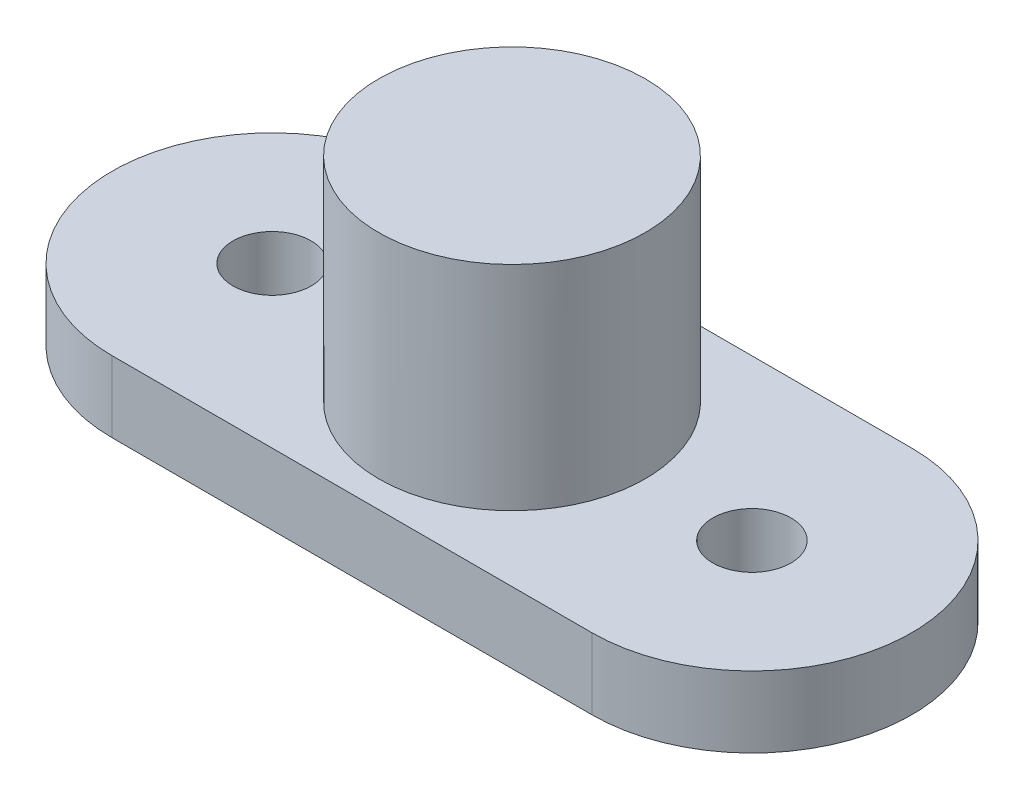
ISO-10303-21;
HEADER;
FILE_DESCRIPTION(('STEP AP214'),'2;1');
FILE_NAME('part.step','',(''),(''),'','','');
FILE_SCHEMA(('AUTOMOTIVE_DESIGN { 1 0 10303 214 1 1 1 1 }'));
ENDSEC;
DATA;
#1=APPLICATION_CONTEXT('core data for automotive mechanical design processes');
#2=APPLICATION_PROTOCOL_DEFINITION('international standard','automotive_design',2000,#1);
#3=PRODUCT_CONTEXT('',#1,'mechanical');
#4=PRODUCT('Part','Part','',(#3));
#5=PRODUCT_RELATED_PRODUCT_CATEGORY('part','',(#4));
#6=PRODUCT_DEFINITION_FORMATION('','',#4);
#7=PRODUCT_DEFINITION_CONTEXT('part definition',#1,'design');
#8=PRODUCT_DEFINITION('design','',#6,#7);
#9=PRODUCT_DEFINITION_SHAPE('','',#8);
#10=(LENGTH_UNIT() NAMED_UNIT(*) SI_UNIT(.MILLI.,.METRE.));
#11=(NAMED_UNIT(*) PLANE_ANGLE_UNIT() SI_UNIT($,.RADIAN.));
#12=(NAMED_UNIT(*) SI_UNIT($,.STERADIAN.) SOLID_ANGLE_UNIT());
#13=UNCERTAINTY_MEASURE_WITH_UNIT(LENGTH_MEASURE(1.E-05),#10,'distance_accuracy_value','');
#14=(GEOMETRIC_REPRESENTATION_CONTEXT(3) GLOBAL_UNCERTAINTY_ASSIGNED_CONTEXT((#13)) GLOBAL_UNIT_ASSIGNED_CONTEXT((#10,
#11,#12)) REPRESENTATION_CONTEXT('',''));
#15=CARTESIAN_POINT('',(0.,0.,0.));
#16=DIRECTION('',(0.,0.,1.));
#17=DIRECTION('',(1.,0.,0.));
#18=AXIS2_PLACEMENT_3D('',#15,#16,#17);
#19=CARTESIAN_POINT('',(0.,2.,-4.49950296687665));
#20=DIRECTION('',(0.,0.,-1.));
#21=DIRECTION('',(-1.,0.,0.));
#22=AXIS2_PLACEMENT_3D('',#19,#20,#21);
#23=PLANE('',#22);
#24=DIRECTION('',(1.,0.,0.));
#25=VECTOR('',#24,1.);
#26=CARTESIAN_POINT('',(0.,0.,-4.49950296687665));
#27=LINE('',#26,#25);
#28=CARTESIAN_POINT('',(-6.75,0.,-4.49950296687665));
#29=VERTEX_POINT('',#28);
#30=CARTESIAN_POINT('',(6.75,0.,-4.49950296687665));
#31=VERTEX_POINT('',#30);
#32=EDGE_CURVE('E119',#29,#31,#27,.T.);
#33=ORIENTED_EDGE('',*,*,#32,.F.);
#34=DIRECTION('',(0.,-1.,0.));
#35=VECTOR('',#34,1.);
#36=CARTESIAN_POINT('',(-6.75,2.,-4.49950296687665));
#37=LINE('',#36,#35);
#38=CARTESIAN_POINT('',(-6.75,2.,-4.49950296687665));
#39=VERTEX_POINT('',#38);
#40=EDGE_CURVE('E11',#39,#29,#37,.T.);
#41=ORIENTED_EDGE('',*,*,#40,.F.);
#42=DIRECTION('',(1.,0.,0.));
#43=VECTOR('',#42,1.);
#44=CARTESIAN_POINT('',(0.,2.,-4.49950296687665));
#45=LINE('',#44,#43);
#46=CARTESIAN_POINT('',(6.75,2.,-4.49950296687665));
#47=VERTEX_POINT('',#46);
#48=EDGE_CURVE('E96',#39,#47,#45,.T.);
#49=ORIENTED_EDGE('',*,*,#48,.T.);
#50=DIRECTION('',(0.,-1.,0.));
#51=VECTOR('',#50,1.);
#52=CARTESIAN_POINT('',(6.75,2.,-4.49950296687665));
#53=LINE('',#52,#51);
#54=EDGE_CURVE('E57',#47,#31,#53,.T.);
#55=ORIENTED_EDGE('',*,*,#54,.T.);
#56=EDGE_LOOP('',(#33,#41,#49,#55));
#57=FACE_BOUND('',#56,.T.);
#58=ADVANCED_FACE('F39',(#57),#23,.T.);
#59=CARTESIAN_POINT('',(-6.75,2.,0.));
#60=DIRECTION('',(0.,-1.,0.));
#61=DIRECTION('',(0.,0.,-1.));
#62=AXIS2_PLACEMENT_3D('',#59,#60,#61);
#63=CYLINDRICAL_SURFACE('',#62,4.49950296687665);
#64=CARTESIAN_POINT('',(-6.75,0.,0.));
#65=DIRECTION('',(0.,1.,0.));
#66=DIRECTION('',(0.,0.,1.));
#67=AXIS2_PLACEMENT_3D('',#64,#65,#66);
#68=CIRCLE('',#67,4.49950296687665);
#69=CARTESIAN_POINT('',(-6.75,0.,4.49950296687665));
#70=VERTEX_POINT('',#69);
#71=EDGE_CURVE('E102',#29,#70,#68,.T.);
#72=ORIENTED_EDGE('',*,*,#71,.T.);
#73=DIRECTION('',(0.,-1.,0.));
#74=VECTOR('',#73,1.);
#75=CARTESIAN_POINT('',(-6.75,2.,4.49950296687665));
#76=LINE('',#75,#74);
#77=CARTESIAN_POINT('',(-6.75,2.,4.49950296687665));
#78=VERTEX_POINT('',#77);
#79=EDGE_CURVE('E49',#78,#70,#76,.T.);
#80=ORIENTED_EDGE('',*,*,#79,.F.);
#81=CARTESIAN_POINT('',(-6.75,2.,0.));
#82=DIRECTION('',(0.,1.,0.));
#83=DIRECTION('',(0.,0.,1.));
#84=AXIS2_PLACEMENT_3D('',#81,#82,#83);
#85=CIRCLE('',#84,4.49950296687665);
#86=EDGE_CURVE('E92',#39,#78,#85,.T.);
#87=ORIENTED_EDGE('',*,*,#86,.F.);
#88=ORIENTED_EDGE('',*,*,#40,.T.);
#89=EDGE_LOOP('',(#72,#80,#87,#88));
#90=FACE_BOUND('',#89,.T.);
#91=ADVANCED_FACE('F100',(#90),#63,.T.);
#92=CARTESIAN_POINT('',(0.,2.,4.49950296687665));
#93=DIRECTION('',(0.,0.,-1.));
#94=DIRECTION('',(-1.,0.,0.));
#95=AXIS2_PLACEMENT_3D('',#92,#93,#94);
#96=PLANE('',#95);
#97=DIRECTION('',(1.,0.,0.));
#98=VECTOR('',#97,1.);
#99=CARTESIAN_POINT('',(0.,0.,4.49950296687665));
#100=LINE('',#99,#98);
#101=CARTESIAN_POINT('',(6.75,0.,4.49950296687665));
#102=VERTEX_POINT('',#101);
#103=EDGE_CURVE('E114',#70,#102,#100,.T.);
#104=ORIENTED_EDGE('',*,*,#103,.T.);
#105=DIRECTION('',(0.,-1.,0.));
#106=VECTOR('',#105,1.);
#107=CARTESIAN_POINT('',(6.75,2.,4.49950296687665));
#108=LINE('',#107,#106);
#109=CARTESIAN_POINT('',(6.75,2.,4.49950296687665));
#110=VERTEX_POINT('',#109);
#111=EDGE_CURVE('E71',#110,#102,#108,.T.);
#112=ORIENTED_EDGE('',*,*,#111,.F.);
#113=DIRECTION('',(1.,0.,0.));
#114=VECTOR('',#113,1.);
#115=CARTESIAN_POINT('',(0.,2.,4.49950296687665));
#116=LINE('',#115,#114);
#117=EDGE_CURVE('E83',#78,#110,#116,.T.);
#118=ORIENTED_EDGE('',*,*,#117,.F.);
#119=ORIENTED_EDGE('',*,*,#79,.T.);
#120=EDGE_LOOP('',(#104,#112,#118,#119));
#121=FACE_BOUND('',#120,.T.);
#122=ADVANCED_FACE('F85',(#121),#96,.F.);
#123=CARTESIAN_POINT('',(-6.75,2.,0.));
#124=DIRECTION('',(0.,-1.,0.));
#125=DIRECTION('',(0.,0.,-1.));
#126=AXIS2_PLACEMENT_3D('',#123,#124,#125);
#127=CYLINDRICAL_SURFACE('',#126,1.1);
#128=CARTESIAN_POINT('',(-6.75,2.,0.));
#129=DIRECTION('',(0.,1.,0.));
#130=DIRECTION('',(0.,0.,1.));
#131=AXIS2_PLACEMENT_3D('',#128,#129,#130);
#132=CIRCLE('',#131,1.1);
#133=CARTESIAN_POINT('',(-6.75,2.,1.1));
#134=VERTEX_POINT('',#133);
#135=EDGE_CURVE('E139',#134,#134,#132,.T.);
#136=ORIENTED_EDGE('',*,*,#135,.T.);
#137=EDGE_LOOP('',(#136));
#138=FACE_BOUND('',#137,.T.);
#139=CARTESIAN_POINT('',(-6.75,0.,0.));
#140=DIRECTION('',(0.,1.,0.));
#141=DIRECTION('',(0.,0.,1.));
#142=AXIS2_PLACEMENT_3D('',#139,#140,#141);
#143=CIRCLE('',#142,1.1);
#144=CARTESIAN_POINT('',(-6.75,0.,1.1));
#145=VERTEX_POINT('',#144);
#146=EDGE_CURVE('E122',#145,#145,#143,.T.);
#147=ORIENTED_EDGE('',*,*,#146,.F.);
#148=EDGE_LOOP('',(#147));
#149=FACE_BOUND('',#148,.T.);
#150=ADVANCED_FACE('F168',(#138,#149),#127,.F.);
#151=CARTESIAN_POINT('',(6.75,2.,0.));
#152=DIRECTION('',(0.,-1.,0.));
#153=DIRECTION('',(0.,0.,-1.));
#154=AXIS2_PLACEMENT_3D('',#151,#152,#153);
#155=CYLINDRICAL_SURFACE('',#154,1.1);
#156=CARTESIAN_POINT('',(6.75,2.,0.));
#157=DIRECTION('',(0.,1.,0.));
#158=DIRECTION('',(0.,0.,1.));
#159=AXIS2_PLACEMENT_3D('',#156,#157,#158);
#160=CIRCLE('',#159,1.1);
#161=CARTESIAN_POINT('',(6.75,2.,1.1));
#162=VERTEX_POINT('',#161);
#163=EDGE_CURVE('E113',#162,#162,#160,.T.);
#164=ORIENTED_EDGE('',*,*,#163,.T.);
#165=EDGE_LOOP('',(#164));
#166=FACE_BOUND('',#165,.T.);
#167=CARTESIAN_POINT('',(6.75,0.,0.));
#168=DIRECTION('',(0.,1.,0.));
#169=DIRECTION('',(0.,0.,1.));
#170=AXIS2_PLACEMENT_3D('',#167,#168,#169);
#171=CIRCLE('',#170,1.1);
#172=CARTESIAN_POINT('',(6.75,0.,1.1));
#173=VERTEX_POINT('',#172);
#174=EDGE_CURVE('E126',#173,#173,#171,.T.);
#175=ORIENTED_EDGE('',*,*,#174,.F.);
#176=EDGE_LOOP('',(#175));
#177=FACE_BOUND('',#176,.T.);
#178=ADVANCED_FACE('F41',(#166,#177),#155,.F.);
#179=CARTESIAN_POINT('',(6.75,2.,0.));
#180=DIRECTION('',(0.,-1.,0.));
#181=DIRECTION('',(0.,0.,-1.));
#182=AXIS2_PLACEMENT_3D('',#179,#180,#181);
#183=CYLINDRICAL_SURFACE('',#182,4.49950296687665);
#184=CARTESIAN_POINT('',(6.75,0.,0.));
#185=DIRECTION('',(0.,1.,0.));
#186=DIRECTION('',(0.,0.,1.));
#187=AXIS2_PLACEMENT_3D('',#184,#185,#186);
#188=CIRCLE('',#187,4.49950296687665);
#189=EDGE_CURVE('E109',#31,#102,#188,.F.);
#190=ORIENTED_EDGE('',*,*,#189,.F.);
#191=ORIENTED_EDGE('',*,*,#54,.F.);
#192=CARTESIAN_POINT('',(6.75,2.,0.));
#193=DIRECTION('',(0.,1.,0.));
#194=DIRECTION('',(0.,0.,1.));
#195=AXIS2_PLACEMENT_3D('',#192,#193,#194);
#196=CIRCLE('',#195,4.49950296687665);
#197=EDGE_CURVE('E91',#47,#110,#196,.F.);
#198=ORIENTED_EDGE('',*,*,#197,.T.);
#199=ORIENTED_EDGE('',*,*,#111,.T.);
#200=EDGE_LOOP('',(#190,#191,#198,#199));
#201=FACE_BOUND('',#200,.T.);
#202=ADVANCED_FACE('F175',(#201),#183,.T.);
#203=CARTESIAN_POINT('',(0.,2.,0.));
#204=DIRECTION('',(0.,1.,0.));
#205=DIRECTION('',(0.,0.,1.));
#206=AXIS2_PLACEMENT_3D('',#203,#204,#205);
#207=PLANE('',#206);
#208=ORIENTED_EDGE('',*,*,#163,.F.);
#209=EDGE_LOOP('',(#208));
#210=FACE_BOUND('',#209,.T.);
#211=ORIENTED_EDGE('',*,*,#135,.F.);
#212=EDGE_LOOP('',(#211));
#213=FACE_BOUND('',#212,.T.);
#214=CARTESIAN_POINT('',(0.,2.,0.));
#215=DIRECTION('',(0.,1.,0.));
#216=DIRECTION('',(0.,0.,1.));
#217=AXIS2_PLACEMENT_3D('',#214,#215,#216);
#218=CIRCLE('',#217,3.75);
#219=CARTESIAN_POINT('',(0.,2.,3.75));
#220=VERTEX_POINT('',#219);
#221=EDGE_CURVE('E135',#220,#220,#218,.T.);
#222=ORIENTED_EDGE('',*,*,#221,.F.);
#223=EDGE_LOOP('',(#222));
#224=FACE_BOUND('',#223,.T.);
#225=ORIENTED_EDGE('',*,*,#48,.F.);
#226=ORIENTED_EDGE('',*,*,#86,.T.);
#227=ORIENTED_EDGE('',*,*,#117,.T.);
#228=ORIENTED_EDGE('',*,*,#197,.F.);
#229=EDGE_LOOP('',(#225,#226,#227,#228));
#230=FACE_BOUND('',#229,.T.);
#231=ADVANCED_FACE('F95',(#210,#213,#224,#230),#207,.T.);
#232=CARTESIAN_POINT('',(0.,0.,0.));
#233=DIRECTION('',(0.,1.,0.));
#234=DIRECTION('',(0.,0.,1.));
#235=AXIS2_PLACEMENT_3D('',#232,#233,#234);
#236=PLANE('',#235);
#237=ORIENTED_EDGE('',*,*,#174,.T.);
#238=EDGE_LOOP('',(#237));
#239=FACE_BOUND('',#238,.T.);
#240=ORIENTED_EDGE('',*,*,#146,.T.);
#241=EDGE_LOOP('',(#240));
#242=FACE_BOUND('',#241,.T.);
#243=ORIENTED_EDGE('',*,*,#32,.T.);
#244=ORIENTED_EDGE('',*,*,#189,.T.);
#245=ORIENTED_EDGE('',*,*,#103,.F.);
#246=ORIENTED_EDGE('',*,*,#71,.F.);
#247=EDGE_LOOP('',(#243,#244,#245,#246));
#248=FACE_BOUND('',#247,.T.);
#249=ADVANCED_FACE('F158',(#239,#242,#248),#236,.F.);
#250=CARTESIAN_POINT('',(0.,8.,0.));
#251=DIRECTION('',(0.,-1.,0.));
#252=DIRECTION('',(0.,0.,-1.));
#253=AXIS2_PLACEMENT_3D('',#250,#251,#252);
#254=CYLINDRICAL_SURFACE('',#253,3.75);
#255=ORIENTED_EDGE('',*,*,#221,.T.);
#256=EDGE_LOOP('',(#255));
#257=FACE_BOUND('',#256,.T.);
#258=CARTESIAN_POINT('',(0.,8.,0.));
#259=DIRECTION('',(0.,-1.,0.));
#260=DIRECTION('',(0.,0.,-1.));
#261=AXIS2_PLACEMENT_3D('',#258,#259,#260);
#262=CIRCLE('',#261,3.75);
#263=CARTESIAN_POINT('',(0.,8.,-3.75));
#264=VERTEX_POINT('',#263);
#265=EDGE_CURVE('E130',#264,#264,#262,.T.);
#266=ORIENTED_EDGE('',*,*,#265,.T.);
#267=EDGE_LOOP('',(#266));
#268=FACE_BOUND('',#267,.T.);
#269=ADVANCED_FACE('F150',(#257,#268),#254,.T.);
#270=CARTESIAN_POINT('',(0.,8.,0.));
#271=DIRECTION('',(0.,-1.,0.));
#272=DIRECTION('',(0.,0.,-1.));
#273=AXIS2_PLACEMENT_3D('',#270,#271,#272);
#274=PLANE('',#273);
#275=ORIENTED_EDGE('',*,*,#265,.F.);
#276=EDGE_LOOP('',(#275));
#277=FACE_BOUND('',#276,.T.);
#278=ADVANCED_FACE('F152',(#277),#274,.F.);
#279=CLOSED_SHELL('',(#58,#91,#122,#150,#178,#202,#231,#249,#269,#278));
#280=MANIFOLD_SOLID_BREP('B2',#279);
#281=ADVANCED_BREP_SHAPE_REPRESENTATION('',(#18,#280),#14);
#282=SHAPE_DEFINITION_REPRESENTATION(#9,#281);
ENDSEC;
END-ISO-10303-21;
